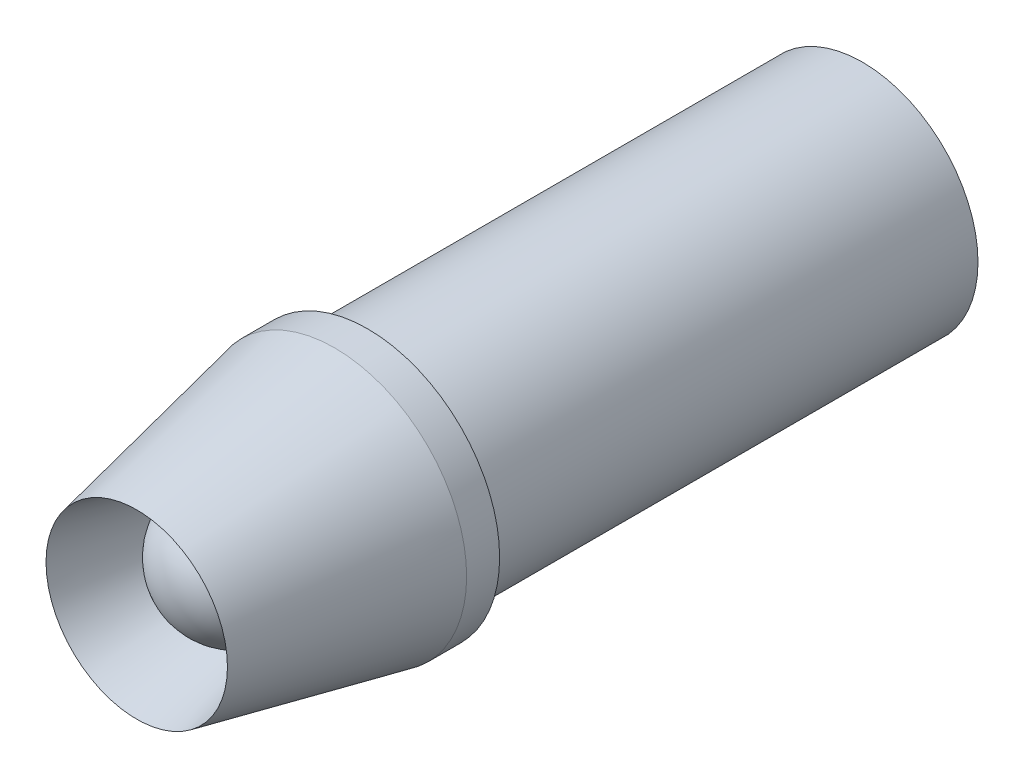
ISO-10303-21;
HEADER;
FILE_DESCRIPTION(('STEP AP214'),'2;1');
FILE_NAME('part.step','',(''),(''),'','','');
FILE_SCHEMA(('AUTOMOTIVE_DESIGN { 1 0 10303 214 1 1 1 1 }'));
ENDSEC;
DATA;
#1=APPLICATION_CONTEXT('core data for automotive mechanical design processes');
#2=APPLICATION_PROTOCOL_DEFINITION('international standard','automotive_design',2000,#1);
#3=PRODUCT_CONTEXT('',#1,'mechanical');
#4=PRODUCT('Part','Part','',(#3));
#5=PRODUCT_RELATED_PRODUCT_CATEGORY('part','',(#4));
#6=PRODUCT_DEFINITION_FORMATION('','',#4);
#7=PRODUCT_DEFINITION_CONTEXT('part definition',#1,'design');
#8=PRODUCT_DEFINITION('design','',#6,#7);
#9=PRODUCT_DEFINITION_SHAPE('','',#8);
#10=(LENGTH_UNIT() NAMED_UNIT(*) SI_UNIT(.MILLI.,.METRE.));
#11=(NAMED_UNIT(*) PLANE_ANGLE_UNIT() SI_UNIT($,.RADIAN.));
#12=(NAMED_UNIT(*) SI_UNIT($,.STERADIAN.) SOLID_ANGLE_UNIT());
#13=UNCERTAINTY_MEASURE_WITH_UNIT(LENGTH_MEASURE(1.E-05),#10,'distance_accuracy_value','');
#14=(GEOMETRIC_REPRESENTATION_CONTEXT(3) GLOBAL_UNCERTAINTY_ASSIGNED_CONTEXT((#13)) GLOBAL_UNIT_ASSIGNED_CONTEXT((#10,
#11,#12)) REPRESENTATION_CONTEXT('',''));
#15=CARTESIAN_POINT('',(0.,0.,0.));
#16=DIRECTION('',(0.,0.,1.));
#17=DIRECTION('',(1.,0.,0.));
#18=AXIS2_PLACEMENT_3D('',#15,#16,#17);
#19=CARTESIAN_POINT('',(0.,0.,3.99999999999997));
#20=DIRECTION('',(0.,0.,1.));
#21=DIRECTION('',(1.,0.,0.));
#22=AXIS2_PLACEMENT_3D('',#19,#20,#21);
#23=PLANE('',#22);
#24=CARTESIAN_POINT('',(0.,0.,3.99999999999997));
#25=DIRECTION('',(0.,0.,1.));
#26=DIRECTION('',(1.,0.,0.));
#27=AXIS2_PLACEMENT_3D('',#24,#25,#26);
#28=CIRCLE('',#27,2.);
#29=CARTESIAN_POINT('',(2.,0.,3.99999999999997));
#30=VERTEX_POINT('',#29);
#31=EDGE_CURVE('E11',#30,#30,#28,.T.);
#32=ORIENTED_EDGE('',*,*,#31,.F.);
#33=EDGE_LOOP('',(#32));
#34=FACE_BOUND('',#33,.T.);
#35=ADVANCED_FACE('F45',(#34),#23,.F.);
#36=CARTESIAN_POINT('',(0.,0.,3.99999999999997));
#37=DIRECTION('',(0.,0.,1.));
#38=DIRECTION('',(1.,0.,0.));
#39=AXIS2_PLACEMENT_3D('',#36,#37,#38);
#40=SPHERICAL_SURFACE('',#39,2.);
#41=ORIENTED_EDGE('',*,*,#31,.T.);
#42=EDGE_LOOP('',(#41));
#43=FACE_BOUND('',#42,.T.);
#44=ADVANCED_FACE('F47',(#43),#40,.T.);
#45=CLOSED_SHELL('',(#35,#44));
#46=MANIFOLD_SOLID_BREP('B2',#45);
#47=CARTESIAN_POINT('',(0.,0.,0.));
#48=DIRECTION('',(0.,0.,1.));
#49=DIRECTION('',(1.,0.,0.));
#50=AXIS2_PLACEMENT_3D('',#47,#48,#49);
#51=PLANE('',#50);
#52=CARTESIAN_POINT('',(0.,0.,0.));
#53=DIRECTION('',(0.,0.,1.));
#54=DIRECTION('',(1.,0.,0.));
#55=AXIS2_PLACEMENT_3D('',#52,#53,#54);
#56=CIRCLE('',#55,3.5);
#57=CARTESIAN_POINT('',(3.5,0.,0.));
#58=VERTEX_POINT('',#57);
#59=EDGE_CURVE('E44',#58,#58,#56,.F.);
#60=ORIENTED_EDGE('',*,*,#59,.F.);
#61=EDGE_LOOP('',(#60));
#62=FACE_BOUND('',#61,.T.);
#63=CARTESIAN_POINT('',(0.,0.,0.));
#64=DIRECTION('',(0.,0.,1.));
#65=DIRECTION('',(1.,0.,0.));
#66=AXIS2_PLACEMENT_3D('',#63,#64,#65);
#67=CIRCLE('',#66,4.);
#68=CARTESIAN_POINT('',(4.,0.,0.));
#69=VERTEX_POINT('',#68);
#70=EDGE_CURVE('E93',#69,#69,#67,.T.);
#71=ORIENTED_EDGE('',*,*,#70,.F.);
#72=EDGE_LOOP('',(#71));
#73=FACE_BOUND('',#72,.T.);
#74=ADVANCED_FACE('F73',(#62,#73),#51,.F.);
#75=CARTESIAN_POINT('',(0.,0.,7.));
#76=DIRECTION('',(0.,0.,-1.));
#77=DIRECTION('',(-1.,0.,0.));
#78=AXIS2_PLACEMENT_3D('',#75,#76,#77);
#79=CYLINDRICAL_SURFACE('',#78,4.);
#80=CARTESIAN_POINT('',(0.,0.,0.999999999999906));
#81=DIRECTION('',(0.,0.,1.));
#82=DIRECTION('',(1.,0.,0.));
#83=AXIS2_PLACEMENT_3D('',#80,#81,#82);
#84=CIRCLE('',#83,4.);
#85=CARTESIAN_POINT('',(-4.,0.,0.999999999999906));
#86=VERTEX_POINT('',#85);
#87=EDGE_CURVE('E84',#86,#86,#84,.F.);
#88=ORIENTED_EDGE('',*,*,#87,.T.);
#89=EDGE_LOOP('',(#88));
#90=FACE_BOUND('',#89,.T.);
#91=ORIENTED_EDGE('',*,*,#70,.T.);
#92=EDGE_LOOP('',(#91));
#93=FACE_BOUND('',#92,.T.);
#94=ADVANCED_FACE('F118',(#90,#93),#79,.T.);
#95=CARTESIAN_POINT('',(0.,0.,7.));
#96=DIRECTION('',(0.,0.,-1.));
#97=DIRECTION('',(-1.,0.,0.));
#98=AXIS2_PLACEMENT_3D('',#95,#96,#97);
#99=CYLINDRICAL_SURFACE('',#98,2.);
#100=CARTESIAN_POINT('',(0.,0.,3.99999999999997));
#101=DIRECTION('',(0.,0.,1.));
#102=DIRECTION('',(1.,0.,0.));
#103=AXIS2_PLACEMENT_3D('',#100,#101,#102);
#104=CIRCLE('',#103,2.);
#105=CARTESIAN_POINT('',(2.,0.,3.99999999999997));
#106=VERTEX_POINT('',#105);
#107=EDGE_CURVE('E80',#106,#106,#104,.T.);
#108=ORIENTED_EDGE('',*,*,#107,.T.);
#109=EDGE_LOOP('',(#108));
#110=FACE_BOUND('',#109,.T.);
#111=CARTESIAN_POINT('',(0.,0.,0.));
#112=DIRECTION('',(0.,0.,1.));
#113=DIRECTION('',(1.,0.,0.));
#114=AXIS2_PLACEMENT_3D('',#111,#112,#113);
#115=CIRCLE('',#114,2.);
#116=CARTESIAN_POINT('',(2.,0.,0.));
#117=VERTEX_POINT('',#116);
#118=EDGE_CURVE('E96',#117,#117,#115,.T.);
#119=ORIENTED_EDGE('',*,*,#118,.F.);
#120=EDGE_LOOP('',(#119));
#121=FACE_BOUND('',#120,.T.);
#122=ADVANCED_FACE('F124',(#110,#121),#99,.F.);
#123=CARTESIAN_POINT('',(0.,0.,7.));
#124=DIRECTION('',(0.,0.,-1.));
#125=DIRECTION('',(-1.,0.,0.));
#126=AXIS2_PLACEMENT_3D('',#123,#124,#125);
#127=CONICAL_SURFACE('',#126,2.75,0.205395389189764);
#128=CARTESIAN_POINT('',(0.,0.,7.));
#129=DIRECTION('',(0.,0.,1.));
#130=DIRECTION('',(1.,0.,0.));
#131=AXIS2_PLACEMENT_3D('',#128,#129,#130);
#132=CIRCLE('',#131,2.75);
#133=CARTESIAN_POINT('',(-2.75,0.,7.));
#134=VERTEX_POINT('',#133);
#135=EDGE_CURVE('E88',#134,#134,#132,.T.);
#136=CARTESIAN_POINT('',(-4.,0.,0.999999999999906));
#137=CARTESIAN_POINT('',(-3.98697916666667,0.,1.06249999999991));
#138=CARTESIAN_POINT('',(-3.97395833333333,0.,1.12499999999991));
#139=CARTESIAN_POINT('',(-3.94791666666667,0.,1.24999999999991));
#140=CARTESIAN_POINT('',(-3.93489583333333,0.,1.31249999999991));
#141=CARTESIAN_POINT('',(-3.90885416666667,0.,1.43749999999991));
#142=CARTESIAN_POINT('',(-3.89583333333333,0.,1.49999999999991));
#143=CARTESIAN_POINT('',(-3.86979166666667,0.,1.62499999999992));
#144=CARTESIAN_POINT('',(-3.85677083333333,0.,1.68749999999992));
#145=CARTESIAN_POINT('',(-3.83072916666667,0.,1.81249999999992));
#146=CARTESIAN_POINT('',(-3.81770833333333,0.,1.87499999999992));
#147=CARTESIAN_POINT('',(-3.79166666666667,0.,1.99999999999992));
#148=CARTESIAN_POINT('',(-3.77864583333333,0.,2.06249999999992));
#149=CARTESIAN_POINT('',(-3.75260416666667,0.,2.18749999999992));
#150=CARTESIAN_POINT('',(-3.73958333333333,0.,2.24999999999992));
#151=CARTESIAN_POINT('',(-3.71354166666667,0.,2.37499999999993));
#152=CARTESIAN_POINT('',(-3.70052083333333,0.,2.43749999999993));
#153=CARTESIAN_POINT('',(-3.67447916666667,0.,2.56249999999993));
#154=CARTESIAN_POINT('',(-3.66145833333333,0.,2.62499999999993));
#155=CARTESIAN_POINT('',(-3.63541666666667,0.,2.74999999999993));
#156=CARTESIAN_POINT('',(-3.62239583333333,0.,2.81249999999993));
#157=CARTESIAN_POINT('',(-3.59635416666667,0.,2.93749999999994));
#158=CARTESIAN_POINT('',(-3.58333333333333,0.,2.99999999999994));
#159=CARTESIAN_POINT('',(-3.55729166666667,0.,3.12499999999994));
#160=CARTESIAN_POINT('',(-3.54427083333333,0.,3.18749999999994));
#161=CARTESIAN_POINT('',(-3.51822916666667,0.,3.31249999999994));
#162=CARTESIAN_POINT('',(-3.50520833333333,0.,3.37499999999994));
#163=CARTESIAN_POINT('',(-3.47916666666667,0.,3.49999999999994));
#164=CARTESIAN_POINT('',(-3.46614583333333,0.,3.56249999999995));
#165=CARTESIAN_POINT('',(-3.44010416666667,0.,3.68749999999995));
#166=CARTESIAN_POINT('',(-3.42708333333333,0.,3.74999999999995));
#167=CARTESIAN_POINT('',(-3.40104166666667,0.,3.87499999999995));
#168=CARTESIAN_POINT('',(-3.38802083333333,0.,3.93749999999995));
#169=CARTESIAN_POINT('',(-3.36197916666667,0.,4.06249999999995));
#170=CARTESIAN_POINT('',(-3.34895833333333,0.,4.12499999999995));
#171=CARTESIAN_POINT('',(-3.32291666666667,0.,4.24999999999996));
#172=CARTESIAN_POINT('',(-3.30989583333333,0.,4.31249999999996));
#173=CARTESIAN_POINT('',(-3.28385416666667,0.,4.43749999999996));
#174=CARTESIAN_POINT('',(-3.27083333333333,0.,4.49999999999996));
#175=CARTESIAN_POINT('',(-3.24479166666667,0.,4.62499999999996));
#176=CARTESIAN_POINT('',(-3.23177083333333,0.,4.68749999999996));
#177=CARTESIAN_POINT('',(-3.20572916666667,0.,4.81249999999997));
#178=CARTESIAN_POINT('',(-3.19270833333333,0.,4.87499999999997));
#179=CARTESIAN_POINT('',(-3.16666666666667,0.,4.99999999999997));
#180=CARTESIAN_POINT('',(-3.15364583333333,0.,5.06249999999997));
#181=CARTESIAN_POINT('',(-3.12760416666667,0.,5.18749999999997));
#182=CARTESIAN_POINT('',(-3.11458333333333,0.,5.24999999999997));
#183=CARTESIAN_POINT('',(-3.08854166666667,0.,5.37499999999997));
#184=CARTESIAN_POINT('',(-3.07552083333333,0.,5.43749999999997));
#185=CARTESIAN_POINT('',(-3.04947916666667,0.,5.56249999999998));
#186=CARTESIAN_POINT('',(-3.03645833333333,0.,5.62499999999998));
#187=CARTESIAN_POINT('',(-3.01041666666667,0.,5.74999999999998));
#188=CARTESIAN_POINT('',(-2.99739583333333,0.,5.81249999999998));
#189=CARTESIAN_POINT('',(-2.97135416666667,0.,5.93749999999998));
#190=CARTESIAN_POINT('',(-2.95833333333333,0.,5.99999999999998));
#191=CARTESIAN_POINT('',(-2.93229166666667,0.,6.12499999999999));
#192=CARTESIAN_POINT('',(-2.91927083333333,0.,6.18749999999999));
#193=CARTESIAN_POINT('',(-2.89322916666667,0.,6.31249999999999));
#194=CARTESIAN_POINT('',(-2.88020833333333,0.,6.37499999999999));
#195=CARTESIAN_POINT('',(-2.85416666666667,0.,6.49999999999999));
#196=CARTESIAN_POINT('',(-2.84114583333333,0.,6.56249999999999));
#197=CARTESIAN_POINT('',(-2.81510416666667,0.,6.68749999999999));
#198=CARTESIAN_POINT('',(-2.80208333333333,0.,6.75));
#199=CARTESIAN_POINT('',(-2.77604166666667,0.,6.875));
#200=CARTESIAN_POINT('',(-2.76302083333333,0.,6.9375));
#201=CARTESIAN_POINT('',(-2.75,0.,7.));
#202=B_SPLINE_CURVE_WITH_KNOTS('',3,(#136,#137,#138,#139,#140,#141,#142,#143,#144,#145,#146,
#147,#148,#149,#150,#151,#152,#153,#154,#155,#156,#157,#158,#159,#160,#161,#162,#163,#164,#165,
#166,#167,#168,#169,#170,#171,#172,#173,#174,#175,#176,#177,#178,#179,#180,#181,#182,#183,#184,
#185,#186,#187,#188,#189,#190,#191,#192,#193,#194,#195,#196,#197,#198,#199,#200,#201),
.UNSPECIFIED.,.F.,.F.,(4,2,2,2,2,2,2,2,2,2,2,2,2,2,2,2,2,2,2,2,2,2,2,2,2,2,2,2,2,2,2,2,4),(0.,
0.191525791752054,0.383051583504107,0.574577375256162,0.766103167008216,0.957628958760269,
1.14915475051232,1.34068054226438,1.53220633401643,1.72373212576849,1.91525791752054,
2.10678370927259,2.29830950102465,2.4898352927767,2.68136108452875,2.87288687628081,
3.06441266803286,3.25593845978492,3.44746425153697,3.63899004328902,3.83051583504108,
4.02204162679313,4.21356741854519,4.40509321029724,4.59661900204929,4.78814479380135,
4.9796705855534,5.17119637730545,5.36272216905751,5.55424796080956,5.74577375256161,
5.93729954431367,6.12882533606572),.UNSPECIFIED.);
#203=EDGE_CURVE('BSEAM128',#86,#134,#202,.T.);
#204=ORIENTED_EDGE('',*,*,#87,.F.);
#205=ORIENTED_EDGE('',*,*,#135,.F.);
#206=ORIENTED_EDGE('',*,*,#203,.T.);
#207=ORIENTED_EDGE('',*,*,#203,.F.);
#208=EDGE_LOOP('',(#204,#206,#205,#207));
#209=FACE_BOUND('',#208,.T.);
#210=ADVANCED_FACE('F128',(#209),#127,.T.);
#211=CARTESIAN_POINT('',(0.,0.,3.99999999999997));
#212=DIRECTION('',(0.,0.,1.));
#213=DIRECTION('',(1.,0.,0.));
#214=AXIS2_PLACEMENT_3D('',#211,#212,#213);
#215=CONICAL_SURFACE('',#214,2.,0.244978663126861);
#216=ORIENTED_EDGE('',*,*,#135,.T.);
#217=EDGE_LOOP('',(#216));
#218=FACE_BOUND('',#217,.T.);
#219=ORIENTED_EDGE('',*,*,#107,.F.);
#220=EDGE_LOOP('',(#219));
#221=FACE_BOUND('',#220,.T.);
#222=ADVANCED_FACE('F75',(#218,#221),#215,.F.);
#223=CARTESIAN_POINT('',(0.,0.,0.));
#224=DIRECTION('',(0.,0.,-1.));
#225=DIRECTION('',(-1.,0.,0.));
#226=AXIS2_PLACEMENT_3D('',#223,#224,#225);
#227=PLANE('',#226);
#228=ORIENTED_EDGE('',*,*,#118,.T.);
#229=EDGE_LOOP('',(#228));
#230=FACE_BOUND('',#229,.T.);
#231=ADVANCED_FACE('F107',(#230),#227,.F.);
#232=CARTESIAN_POINT('',(0.,0.,-15.));
#233=DIRECTION('',(0.,0.,1.));
#234=DIRECTION('',(1.,0.,0.));
#235=AXIS2_PLACEMENT_3D('',#232,#233,#234);
#236=CYLINDRICAL_SURFACE('',#235,3.5);
#237=CARTESIAN_POINT('',(0.,0.,-15.));
#238=DIRECTION('',(0.,0.,-1.));
#239=DIRECTION('',(-1.,0.,0.));
#240=AXIS2_PLACEMENT_3D('',#237,#238,#239);
#241=CIRCLE('',#240,3.5);
#242=CARTESIAN_POINT('',(-3.5,0.,-15.));
#243=VERTEX_POINT('',#242);
#244=EDGE_CURVE('E99',#243,#243,#241,.T.);
#245=ORIENTED_EDGE('',*,*,#244,.F.);
#246=EDGE_LOOP('',(#245));
#247=FACE_BOUND('',#246,.T.);
#248=ORIENTED_EDGE('',*,*,#59,.T.);
#249=EDGE_LOOP('',(#248));
#250=FACE_BOUND('',#249,.T.);
#251=ADVANCED_FACE('F105',(#247,#250),#236,.T.);
#252=CARTESIAN_POINT('',(0.,0.,-15.));
#253=DIRECTION('',(0.,0.,-1.));
#254=DIRECTION('',(-1.,0.,0.));
#255=AXIS2_PLACEMENT_3D('',#252,#253,#254);
#256=PLANE('',#255);
#257=ORIENTED_EDGE('',*,*,#244,.T.);
#258=EDGE_LOOP('',(#257));
#259=FACE_BOUND('',#258,.T.);
#260=ADVANCED_FACE('F103',(#259),#256,.T.);
#261=CLOSED_SHELL('',(#74,#94,#122,#210,#222,#231,#251,#260));
#262=MANIFOLD_SOLID_BREP('B6',#261);
#263=ADVANCED_BREP_SHAPE_REPRESENTATION('',(#18,#46,#262),#14);
#264=SHAPE_DEFINITION_REPRESENTATION(#9,#263);
ENDSEC;
END-ISO-10303-21;
